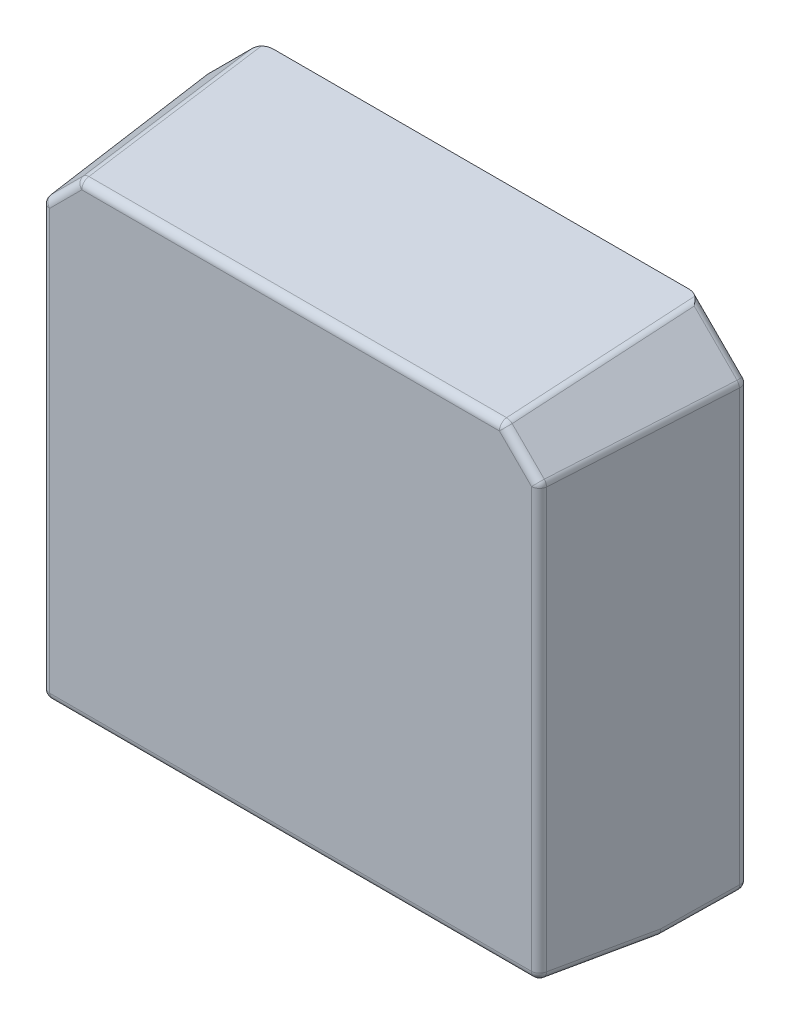
ISO-10303-21;
HEADER;
FILE_DESCRIPTION(('STEP AP214'),'2;1');
FILE_NAME('part.step','',(''),(''),'','','');
FILE_SCHEMA(('AUTOMOTIVE_DESIGN { 1 0 10303 214 1 1 1 1 }'));
ENDSEC;
DATA;
#1=APPLICATION_CONTEXT('core data for automotive mechanical design processes');
#2=APPLICATION_PROTOCOL_DEFINITION('international standard','automotive_design',2000,#1);
#3=PRODUCT_CONTEXT('',#1,'mechanical');
#4=PRODUCT('Part','Part','',(#3));
#5=PRODUCT_RELATED_PRODUCT_CATEGORY('part','',(#4));
#6=PRODUCT_DEFINITION_FORMATION('','',#4);
#7=PRODUCT_DEFINITION_CONTEXT('part definition',#1,'design');
#8=PRODUCT_DEFINITION('design','',#6,#7);
#9=PRODUCT_DEFINITION_SHAPE('','',#8);
#10=(LENGTH_UNIT() NAMED_UNIT(*) SI_UNIT(.MILLI.,.METRE.));
#11=(NAMED_UNIT(*) PLANE_ANGLE_UNIT() SI_UNIT($,.RADIAN.));
#12=(NAMED_UNIT(*) SI_UNIT($,.STERADIAN.) SOLID_ANGLE_UNIT());
#13=UNCERTAINTY_MEASURE_WITH_UNIT(LENGTH_MEASURE(1.E-05),#10,'distance_accuracy_value','');
#14=(GEOMETRIC_REPRESENTATION_CONTEXT(3) GLOBAL_UNCERTAINTY_ASSIGNED_CONTEXT((#13)) GLOBAL_UNIT_ASSIGNED_CONTEXT((#10,
#11,#12)) REPRESENTATION_CONTEXT('',''));
#15=CARTESIAN_POINT('',(0.,0.,0.));
#16=DIRECTION('',(0.,0.,1.));
#17=DIRECTION('',(1.,0.,0.));
#18=AXIS2_PLACEMENT_3D('',#15,#16,#17);
#19=CARTESIAN_POINT('',(0.,0.,2.4));
#20=DIRECTION('',(0.,0.,1.));
#21=DIRECTION('',(0.707106781186548,0.707106781186548,0.));
#22=AXIS2_PLACEMENT_3D('',#19,#20,#21);
#23=PLANE('',#22);
#24=DIRECTION('',(-9.08183003232059E-13,1.,0.));
#25=VECTOR('',#24,1.);
#26=CARTESIAN_POINT('',(5.29981151563744,2.16324235970594,2.4));
#27=LINE('',#26,#25);
#28=CARTESIAN_POINT('',(5.29981151563744,2.16324235970596,2.4));
#29=VERTEX_POINT('',#28);
#30=CARTESIAN_POINT('',(5.29981151563279,7.40908931600959,2.4));
#31=VERTEX_POINT('',#30);
#32=EDGE_CURVE('E11',#29,#31,#27,.T.);
#33=ORIENTED_EDGE('',*,*,#32,.T.);
#34=DIRECTION('',(-0.707106781186547,0.707106781186548,0.));
#35=VECTOR('',#34,1.);
#36=CARTESIAN_POINT('',(5.29981151563268,7.40908931600944,2.4));
#37=LINE('',#36,#35);
#38=CARTESIAN_POINT('',(4.89908931600094,7.80981151564132,2.4));
#39=VERTEX_POINT('',#38);
#40=EDGE_CURVE('E26',#31,#39,#37,.T.);
#41=ORIENTED_EDGE('',*,*,#40,.T.);
#42=DIRECTION('',(-1.,-6.6262173676464E-13,0.));
#43=VECTOR('',#42,1.);
#44=CARTESIAN_POINT('',(4.89908931600097,7.80981151564114,2.4));
#45=LINE('',#44,#43);
#46=CARTESIAN_POINT('',(-0.319089316012182,7.80981151563779,2.4));
#47=VERTEX_POINT('',#46);
#48=EDGE_CURVE('E999',#39,#47,#45,.T.);
#49=ORIENTED_EDGE('',*,*,#48,.T.);
#50=DIRECTION('',(-0.707106781185613,-0.707106781187482,0.));
#51=VECTOR('',#50,1.);
#52=CARTESIAN_POINT('',(-0.319089316012032,7.80981151563769,2.4));
#53=LINE('',#52,#51);
#54=CARTESIAN_POINT('',(-0.71981151564332,7.40908931600549,2.4));
#55=VERTEX_POINT('',#54);
#56=EDGE_CURVE('E998',#47,#55,#53,.T.);
#57=ORIENTED_EDGE('',*,*,#56,.T.);
#58=DIRECTION('',(9.08183003232113E-13,-1.,0.));
#59=VECTOR('',#58,1.);
#60=CARTESIAN_POINT('',(-0.719811515643137,7.40908931600552,2.4));
#61=LINE('',#60,#59);
#62=CARTESIAN_POINT('',(-0.719811515638372,2.16324235970231,2.4));
#63=VERTEX_POINT('',#62);
#64=EDGE_CURVE('E412',#55,#63,#61,.T.);
#65=ORIENTED_EDGE('',*,*,#64,.T.);
#66=DIRECTION('',(1.,6.08115713853634E-13,0.));
#67=VECTOR('',#66,1.);
#68=CARTESIAN_POINT('',(-0.719811515638372,2.1632423597023,2.4));
#69=LINE('',#68,#67);
#70=EDGE_CURVE('E409',#63,#29,#69,.T.);
#71=ORIENTED_EDGE('',*,*,#70,.T.);
#72=EDGE_LOOP('',(#33,#41,#49,#57,#65,#71));
#73=FACE_BOUND('',#72,.T.);
#74=ADVANCED_FACE('F16',(#73),#23,.T.);
#75=CARTESIAN_POINT('',(-1.36,1.94999999999914,1.01));
#76=DIRECTION('',(6.05844652791076E-13,-0.996194698091746,0.087155742747658));
#77=DIRECTION('',(0.705757556807933,0.0617457854188765,0.705757556807933));
#78=AXIS2_PLACEMENT_3D('',#75,#76,#77);
#79=PLANE('',#78);
#80=DIRECTION('',(-0.104135022431484,0.0866818917023642,0.990778555861043));
#81=VECTOR('',#80,1.);
#82=CARTESIAN_POINT('',(5.43539597913032,1.95076251394843,1.01871557427477));
#83=LINE('',#82,#81);
#84=CARTESIAN_POINT('',(5.43539597913032,1.95076251394843,1.01871557427477));
#85=VERTEX_POINT('',#84);
#86=CARTESIAN_POINT('',(5.2998115156375,2.06362288989679,2.30871557427477));
#87=VERTEX_POINT('',#86);
#88=EDGE_CURVE('E407',#85,#87,#83,.T.);
#89=ORIENTED_EDGE('',*,*,#88,.T.);
#90=DIRECTION('',(1.,6.08189487445027E-13,0.));
#91=VECTOR('',#90,1.);
#92=CARTESIAN_POINT('',(-0.719811515638312,2.06362288989313,2.30871557427477));
#93=LINE('',#92,#91);
#94=CARTESIAN_POINT('',(-0.719811515638312,2.06362288989313,2.30871557427477));
#95=VERTEX_POINT('',#94);
#96=EDGE_CURVE('E226',#95,#87,#93,.T.);
#97=ORIENTED_EDGE('',*,*,#96,.F.);
#98=DIRECTION('',(-0.104135022431328,-0.0866818917024912,-0.990778555861048));
#99=VECTOR('',#98,1.);
#100=CARTESIAN_POINT('',(-0.719811515638312,2.06362288989313,2.30871557427477));
#101=LINE('',#100,#99);
#102=CARTESIAN_POINT('',(-0.855395979130932,1.9507625139446,1.01871557427477));
#103=VERTEX_POINT('',#102);
#104=EDGE_CURVE('E410',#95,#103,#101,.T.);
#105=ORIENTED_EDGE('',*,*,#104,.T.);
#106=DIRECTION('',(1.,6.08198556373928E-13,0.));
#107=VECTOR('',#106,1.);
#108=CARTESIAN_POINT('',(-0.855395979130932,1.9507625139446,1.01871557427477));
#109=LINE('',#108,#107);
#110=EDGE_CURVE('E182',#103,#85,#109,.T.);
#111=ORIENTED_EDGE('',*,*,#110,.T.);
#112=EDGE_LOOP('',(#89,#97,#105,#111));
#113=FACE_BOUND('',#112,.T.);
#114=ADVANCED_FACE('F408',(#113),#79,.T.);
#115=CARTESIAN_POINT('',(-1.18414778631301,2.12585221368635,-1.));
#116=DIRECTION('',(6.05821881194367E-13,-0.996194698091746,-0.0871557427476582));
#117=DIRECTION('',(0.705757556807971,-0.0617457854180215,0.705757556807971));
#118=AXIS2_PLACEMENT_3D('',#115,#116,#117);
#119=PLANE('',#118);
#120=DIRECTION('',(-0.104135022431335,-0.0866818917024914,0.990778555861048));
#121=VECTOR('',#120,1.);
#122=CARTESIAN_POINT('',(5.52893874851671,2.02862742448656,0.111284425725234));
#123=LINE('',#122,#121);
#124=CARTESIAN_POINT('',(5.52893874851671,2.02862742448656,0.111284425725234));
#125=VERTEX_POINT('',#124);
#126=CARTESIAN_POINT('',(5.43539597913032,1.95076251394843,1.00128442572524));
#127=VERTEX_POINT('',#126);
#128=EDGE_CURVE('E418',#125,#127,#123,.T.);
#129=ORIENTED_EDGE('',*,*,#128,.T.);
#130=DIRECTION('',(1.,6.08127962844085E-13,0.));
#131=VECTOR('',#130,1.);
#132=CARTESIAN_POINT('',(-0.855395979130932,1.9507625139446,1.00128442572523));
#133=LINE('',#132,#131);
#134=CARTESIAN_POINT('',(-0.855395979130932,1.9507625139446,1.00128442572523));
#135=VERTEX_POINT('',#134);
#136=EDGE_CURVE('E405',#135,#127,#133,.T.);
#137=ORIENTED_EDGE('',*,*,#136,.F.);
#138=DIRECTION('',(-0.104135022431485,0.0866818917023642,-0.990778555861043));
#139=VECTOR('',#138,1.);
#140=CARTESIAN_POINT('',(-0.855395979130932,1.9507625139446,1.00128442572523));
#141=LINE('',#140,#139);
#142=CARTESIAN_POINT('',(-0.948938748517455,2.02862742448262,0.111284425725234));
#143=VERTEX_POINT('',#142);
#144=EDGE_CURVE('E176',#135,#143,#141,.T.);
#145=ORIENTED_EDGE('',*,*,#144,.T.);
#146=DIRECTION('',(-1.,-6.08149101674673E-13,0.));
#147=VECTOR('',#146,1.);
#148=CARTESIAN_POINT('',(-0.948938748517455,2.02862742448262,0.111284425725234));
#149=LINE('',#148,#147);
#150=EDGE_CURVE('E314',#125,#143,#149,.T.);
#151=ORIENTED_EDGE('',*,*,#150,.F.);
#152=EDGE_LOOP('',(#129,#137,#145,#151));
#153=FACE_BOUND('',#152,.T.);
#154=ADVANCED_FACE('F438',(#153),#119,.T.);
#155=CARTESIAN_POINT('',(0.,0.,0.02));
#156=DIRECTION('',(0.,0.,1.));
#157=DIRECTION('',(0.707106781186548,0.707106781186548,0.));
#158=AXIS2_PLACEMENT_3D('',#155,#156,#157);
#159=PLANE('',#158);
#160=DIRECTION('',(0.70710678118655,-0.707106781186546,0.));
#161=VECTOR('',#160,1.);
#162=CARTESIAN_POINT('',(5.52893874851176,7.5039969233771,0.02));
#163=LINE('',#162,#161);
#164=CARTESIAN_POINT('',(4.88293567188563,8.15000000000323,0.02));
#165=VERTEX_POINT('',#164);
#166=CARTESIAN_POINT('',(5.52893874851204,7.50399692337708,0.02));
#167=VERTEX_POINT('',#166);
#168=EDGE_CURVE('E423',#165,#167,#163,.T.);
#169=ORIENTED_EDGE('',*,*,#168,.T.);
#170=DIRECTION('',(9.08376491669893E-13,-1.,0.));
#171=VECTOR('',#170,1.);
#172=CARTESIAN_POINT('',(5.52893874851665,2.1282468942957,0.02));
#173=LINE('',#172,#171);
#174=CARTESIAN_POINT('',(5.52893874851665,2.12824689429573,0.02));
#175=VERTEX_POINT('',#174);
#176=EDGE_CURVE('E353',#167,#175,#173,.T.);
#177=ORIENTED_EDGE('',*,*,#176,.T.);
#178=DIRECTION('',(-1.,-6.08217656415026E-13,0.));
#179=VECTOR('',#178,1.);
#180=CARTESIAN_POINT('',(-0.948938748517515,2.12824689429179,0.02));
#181=LINE('',#180,#179);
#182=CARTESIAN_POINT('',(-0.948938748517515,2.1282468942918,0.02));
#183=VERTEX_POINT('',#182);
#184=EDGE_CURVE('E351',#175,#183,#181,.T.);
#185=ORIENTED_EDGE('',*,*,#184,.T.);
#186=DIRECTION('',(-9.08231924658281E-13,1.,0.));
#187=VECTOR('',#186,1.);
#188=CARTESIAN_POINT('',(-0.948938748522398,7.50399692337283,0.02));
#189=LINE('',#188,#187);
#190=CARTESIAN_POINT('',(-0.9489387485225,7.50399692337295,0.02));
#191=VERTEX_POINT('',#190);
#192=EDGE_CURVE('E343',#183,#191,#189,.T.);
#193=ORIENTED_EDGE('',*,*,#192,.T.);
#194=DIRECTION('',(0.70710678118561,0.707106781187485,0.));
#195=VECTOR('',#194,1.);
#196=CARTESIAN_POINT('',(-0.302935671897146,8.14999999999979,0.02));
#197=LINE('',#196,#195);
#198=CARTESIAN_POINT('',(-0.302935671897146,8.14999999999979,0.02));
#199=VERTEX_POINT('',#198);
#200=EDGE_CURVE('E339',#191,#199,#197,.T.);
#201=ORIENTED_EDGE('',*,*,#200,.T.);
#202=DIRECTION('',(1.,6.62810597559526E-13,0.));
#203=VECTOR('',#202,1.);
#204=CARTESIAN_POINT('',(4.88293567188563,8.15000000000323,0.02));
#205=LINE('',#204,#203);
#206=EDGE_CURVE('E344',#199,#165,#205,.T.);
#207=ORIENTED_EDGE('',*,*,#206,.T.);
#208=EDGE_LOOP('',(#169,#177,#185,#193,#201,#207));
#209=FACE_BOUND('',#208,.T.);
#210=ADVANCED_FACE('F348',(#209),#159,.F.);
#211=CARTESIAN_POINT('',(-0.809851920072954,7.44638527268179,2.4));
#212=DIRECTION('',(-0.703233176254335,0.703233176252473,0.104528463267653));
#213=DIRECTION('',(0.630457498195542,0.548873092330558,0.548873092330558));
#214=AXIS2_PLACEMENT_3D('',#211,#212,#213);
#215=PLANE('',#214);
#216=DIRECTION('',(-0.707106781185612,-0.707106781187483,0.));
#217=VECTOR('',#216,1.);
#218=CARTESIAN_POINT('',(-0.389412633637465,7.88013483326293,2.31045284632677));
#219=LINE('',#218,#217);
#220=CARTESIAN_POINT('',(-0.389412633637471,7.88013483326291,2.31045284632691));
#221=VERTEX_POINT('',#220);
#222=CARTESIAN_POINT('',(-0.790134833268769,7.4794126336305,2.31045284632722));
#223=VERTEX_POINT('',#222);
#224=EDGE_CURVE('E294',#221,#223,#219,.T.);
#225=ORIENTED_EDGE('',*,*,#224,.F.);
#226=DIRECTION('',(-0.0432565808764457,0.10443062421351,-0.993591018949576));
#227=VECTOR('',#226,1.);
#228=CARTESIAN_POINT('',(-0.389412633637465,7.88013483326293,2.31045284632677));
#229=LINE('',#228,#227);
#230=CARTESIAN_POINT('',(-0.484320241005278,8.10926206614204,0.130452846326766));
#231=VERTEX_POINT('',#230);
#232=EDGE_CURVE('E358',#221,#231,#229,.T.);
#233=ORIENTED_EDGE('',*,*,#232,.T.);
#234=DIRECTION('',(0.707106781185612,0.707106781187483,0.));
#235=VECTOR('',#234,1.);
#236=CARTESIAN_POINT('',(-0.484320241005278,8.10926206614204,0.130452846326766));
#237=LINE('',#236,#235);
#238=CARTESIAN_POINT('',(-1.01926206614783,7.5743202409981,0.130452846326607));
#239=VERTEX_POINT('',#238);
#240=EDGE_CURVE('E256',#239,#231,#237,.T.);
#241=ORIENTED_EDGE('',*,*,#240,.F.);
#242=DIRECTION('',(-0.104430624213579,0.0432565808762159,-0.993591018949578));
#243=VECTOR('',#242,1.);
#244=CARTESIAN_POINT('',(-0.79013483326857,7.47941263363077,2.31045284632677));
#245=LINE('',#244,#243);
#246=EDGE_CURVE('E227',#223,#239,#245,.T.);
#247=ORIENTED_EDGE('',*,*,#246,.F.);
#248=EDGE_LOOP('',(#225,#233,#241,#247));
#249=FACE_BOUND('',#248,.T.);
#250=ADVANCED_FACE('F462',(#249),#215,.T.);
#251=CARTESIAN_POINT('',(-0.356385272688502,7.89985192006745,2.4));
#252=DIRECTION('',(-6.59050407435661E-13,0.994521895368273,0.104528463267653));
#253=DIRECTION('',(0.705161999394304,-0.0741155126842861,0.705161999394304));
#254=AXIS2_PLACEMENT_3D('',#251,#252,#253);
#255=PLANE('',#254);
#256=DIRECTION('',(-1.,-6.6262173676464E-13,0.));
#257=VECTOR('',#256,1.);
#258=CARTESIAN_POINT('',(4.89908931600091,7.90926370517797,2.31045284632677));
#259=LINE('',#258,#257);
#260=CARTESIAN_POINT('',(4.89908931600087,7.90926370517794,2.31045284632701));
#261=VERTEX_POINT('',#260);
#262=CARTESIAN_POINT('',(-0.319089316012286,7.90926370517449,2.31045284632703));
#263=VERTEX_POINT('',#262);
#264=EDGE_CURVE('E288',#261,#263,#259,.T.);
#265=ORIENTED_EDGE('',*,*,#264,.F.);
#266=DIRECTION('',(0.043256580876307,0.104430624213567,-0.993591018949576));
#267=VECTOR('',#266,1.);
#268=CARTESIAN_POINT('',(4.89908931600091,7.90926370517797,2.31045284632677));
#269=LINE('',#268,#267);
#270=CARTESIAN_POINT('',(4.99717640306542,8.14606688106303,0.0574211270395492));
#271=VERTEX_POINT('',#270);
#272=EDGE_CURVE('E361',#261,#271,#269,.T.);
#273=ORIENTED_EDGE('',*,*,#272,.T.);
#274=CARTESIAN_POINT('',(4.89344609541201,8.13948957647661,0.120000000000415));
#275=DIRECTION('',(6.63652401607198E-13,-0.99452189536826,-0.104528463267785));
#276=DIRECTION('',(0.994581264610285,-0.0108669934476841,0.103392536189099));
#277=AXIS2_PLACEMENT_3D('',#274,#275,#276);
#278=ELLIPSE('',#277,0.142200344603933,0.100000000000437);
#279=EDGE_CURVE('E263',#165,#271,#278,.T.);
#280=ORIENTED_EDGE('',*,*,#279,.F.);
#281=ORIENTED_EDGE('',*,*,#206,.F.);
#282=CARTESIAN_POINT('',(-0.313446095423615,8.13948957647319,0.120000000000134));
#283=DIRECTION('',(6.524278179281E-13,-0.994521895368261,-0.104528463267769));
#284=DIRECTION('',(0.994581264610187,0.0108669934490825,-0.103392536189897));
#285=AXIS2_PLACEMENT_3D('',#282,#283,#284);
#286=ELLIPSE('',#285,0.142200344603731,0.100000000000142);
#287=CARTESIAN_POINT('',(-0.417176402572797,8.14606688114393,0.0574211262356998));
#288=VERTEX_POINT('',#287);
#289=EDGE_CURVE('E247',#288,#199,#286,.T.);
#290=ORIENTED_EDGE('',*,*,#289,.F.);
#291=DIRECTION('',(-0.0432565808764457,0.10443062421351,-0.993591018949576));
#292=VECTOR('',#291,1.);
#293=CARTESIAN_POINT('',(-0.319089316012097,7.90926370517451,2.31045284632677));
#294=LINE('',#293,#292);
#295=EDGE_CURVE('E251',#263,#288,#294,.T.);
#296=ORIENTED_EDGE('',*,*,#295,.F.);
#297=EDGE_LOOP('',(#265,#273,#280,#281,#290,#296));
#298=FACE_BOUND('',#297,.T.);
#299=ADVANCED_FACE('F465',(#298),#255,.T.);
#300=CARTESIAN_POINT('',(4.93638527267732,7.89985192007095,2.4));
#301=DIRECTION('',(0.703233176253403,0.703233176253405,0.104528463267654));
#302=DIRECTION('',(-0.630457498196484,0.548873092330017,0.548873092330017));
#303=AXIS2_PLACEMENT_3D('',#300,#301,#302);
#304=PLANE('',#303);
#305=DIRECTION('',(-0.707106781186548,0.707106781186547,0.));
#306=VECTOR('',#305,1.);
#307=CARTESIAN_POINT('',(5.37013483325802,7.47941263363478,2.31045284632677));
#308=LINE('',#307,#306);
#309=CARTESIAN_POINT('',(5.37013483325797,7.47941263363479,2.31045284632701));
#310=VERTEX_POINT('',#309);
#311=CARTESIAN_POINT('',(4.96941263362604,7.88013483326668,2.31045284632722));
#312=VERTEX_POINT('',#311);
#313=EDGE_CURVE('E282',#310,#312,#308,.T.);
#314=ORIENTED_EDGE('',*,*,#313,.F.);
#315=DIRECTION('',(0.104430624213501,0.0432565808763762,-0.99359101894958));
#316=VECTOR('',#315,1.);
#317=CARTESIAN_POINT('',(5.37013483325802,7.47941263363478,2.31045284632677));
#318=LINE('',#317,#316);
#319=CARTESIAN_POINT('',(5.59926206613737,7.57432024100224,0.130452846326345));
#320=VERTEX_POINT('',#319);
#321=EDGE_CURVE('E313',#310,#320,#318,.T.);
#322=ORIENTED_EDGE('',*,*,#321,.T.);
#323=DIRECTION('',(0.707106781186549,-0.707106781186546,0.));
#324=VECTOR('',#323,1.);
#325=CARTESIAN_POINT('',(5.5992620661371,7.57432024100244,0.130452846326766));
#326=LINE('',#325,#324);
#327=CARTESIAN_POINT('',(5.06432024099382,8.10926206614572,0.130452846326765));
#328=VERTEX_POINT('',#327);
#329=EDGE_CURVE('E264',#328,#320,#326,.T.);
#330=ORIENTED_EDGE('',*,*,#329,.F.);
#331=DIRECTION('',(0.0432565808763068,0.104430624213569,-0.993591018949575));
#332=VECTOR('',#331,1.);
#333=CARTESIAN_POINT('',(4.96941263362631,7.88013483326648,2.31045284632677));
#334=LINE('',#333,#332);
#335=EDGE_CURVE('E259',#312,#328,#334,.T.);
#336=ORIENTED_EDGE('',*,*,#335,.F.);
#337=EDGE_LOOP('',(#314,#322,#330,#336));
#338=FACE_BOUND('',#337,.T.);
#339=ADVANCED_FACE('F469',(#338),#304,.T.);
#340=CARTESIAN_POINT('',(5.38985192006243,7.44638527268585,2.4));
#341=DIRECTION('',(0.994521895368273,9.03183040849487E-13,0.104528463267653));
#342=DIRECTION('',(-0.0741155126853878,0.705161999394246,0.705161999394246));
#343=AXIS2_PLACEMENT_3D('',#340,#341,#342);
#344=PLANE('',#343);
#345=DIRECTION('',(-0.104135022431329,-0.0866818917024902,0.990778555861048));
#346=VECTOR('',#345,1.);
#347=CARTESIAN_POINT('',(5.62839093805347,2.12824689429583,0.130452846326765));
#348=LINE('',#347,#346);
#349=CARTESIAN_POINT('',(5.62839093805347,2.12824689429582,0.130452846326765));
#350=VERTEX_POINT('',#349);
#351=CARTESIAN_POINT('',(5.53484816866709,2.0503819837577,1.02045284632678));
#352=VERTEX_POINT('',#351);
#353=EDGE_CURVE('E203',#350,#352,#348,.T.);
#354=ORIENTED_EDGE('',*,*,#353,.F.);
#355=DIRECTION('',(9.0821127222798E-13,-1.,0.));
#356=VECTOR('',#355,1.);
#357=CARTESIAN_POINT('',(5.62839093805347,2.12824689429582,0.130452846326765));
#358=LINE('',#357,#356);
#359=CARTESIAN_POINT('',(5.62839093804861,7.50399692337718,0.130452846326607));
#360=VERTEX_POINT('',#359);
#361=EDGE_CURVE('E273',#360,#350,#358,.T.);
#362=ORIENTED_EDGE('',*,*,#361,.F.);
#363=DIRECTION('',(0.104430624213501,0.0432565808763766,-0.99359101894958));
#364=VECTOR('',#363,1.);
#365=CARTESIAN_POINT('',(5.3992637051695,7.40908931600953,2.31045284632677));
#366=LINE('',#365,#364);
#367=CARTESIAN_POINT('',(5.39926370516946,7.40908931600986,2.31045284632722));
#368=VERTEX_POINT('',#367);
#369=EDGE_CURVE('E234',#368,#360,#366,.T.);
#370=ORIENTED_EDGE('',*,*,#369,.F.);
#371=DIRECTION('',(-9.08183003232064E-13,1.,0.));
#372=VECTOR('',#371,1.);
#373=CARTESIAN_POINT('',(5.39926370517427,2.16324235970605,2.31045284632677));
#374=LINE('',#373,#372);
#375=CARTESIAN_POINT('',(5.39926370517427,2.16324235970605,2.31045284632677));
#376=VERTEX_POINT('',#375);
#377=EDGE_CURVE('E277',#376,#368,#374,.T.);
#378=ORIENTED_EDGE('',*,*,#377,.F.);
#379=DIRECTION('',(-0.104135022431484,0.0866818917023645,0.990778555861043));
#380=VECTOR('',#379,1.);
#381=CARTESIAN_POINT('',(5.53484816866709,2.0503819837577,1.02045284632678));
#382=LINE('',#381,#380);
#383=EDGE_CURVE('E206',#352,#376,#382,.T.);
#384=ORIENTED_EDGE('',*,*,#383,.F.);
#385=EDGE_LOOP('',(#354,#362,#370,#378,#384));
#386=FACE_BOUND('',#385,.T.);
#387=ADVANCED_FACE('F391',(#386),#344,.T.);
#388=CARTESIAN_POINT('',(-0.809851920067917,1.9001480799318,2.4));
#389=DIRECTION('',(-0.994521895368273,-9.0324276464428E-13,0.104528463267654));
#390=DIRECTION('',(0.0741155126841147,0.705161999394313,0.705161999394313));
#391=AXIS2_PLACEMENT_3D('',#388,#389,#390);
#392=PLANE('',#391);
#393=DIRECTION('',(-0.104135022431485,0.086681891702366,-0.990778555861043));
#394=VECTOR('',#393,1.);
#395=CARTESIAN_POINT('',(-0.954848168667821,2.05038198375369,1.02045284632676));
#396=LINE('',#395,#394);
#397=CARTESIAN_POINT('',(-0.95484816866782,2.05038198375369,1.02045284632676));
#398=VERTEX_POINT('',#397);
#399=CARTESIAN_POINT('',(-1.04839093805434,2.1282468942917,0.130452846326766));
#400=VERTEX_POINT('',#399);
#401=EDGE_CURVE('E192',#398,#400,#396,.T.);
#402=ORIENTED_EDGE('',*,*,#401,.F.);
#403=DIRECTION('',(-0.104135022431328,-0.0866818917024917,-0.990778555861048));
#404=VECTOR('',#403,1.);
#405=CARTESIAN_POINT('',(-0.8192637051752,2.16324235970221,2.31045284632677));
#406=LINE('',#405,#404);
#407=CARTESIAN_POINT('',(-0.8192637051752,2.16324235970221,2.31045284632677));
#408=VERTEX_POINT('',#407);
#409=EDGE_CURVE('E187',#408,#398,#406,.T.);
#410=ORIENTED_EDGE('',*,*,#409,.F.);
#411=DIRECTION('',(9.08225330926145E-13,-1.,0.));
#412=VECTOR('',#411,1.);
#413=CARTESIAN_POINT('',(-0.819263705179964,7.40908931600543,2.31045284632677));
#414=LINE('',#413,#412);
#415=CARTESIAN_POINT('',(-0.819263705179938,7.40908931600539,2.31045284632701));
#416=VERTEX_POINT('',#415);
#417=EDGE_CURVE('E301',#416,#408,#414,.T.);
#418=ORIENTED_EDGE('',*,*,#417,.F.);
#419=DIRECTION('',(-0.104430624213579,0.0432565808762163,-0.993591018949578));
#420=VECTOR('',#419,1.);
#421=CARTESIAN_POINT('',(-0.819263705179964,7.40908931600543,2.31045284632677));
#422=LINE('',#421,#420);
#423=CARTESIAN_POINT('',(-1.04839093805927,7.50399692337307,0.130452846326345));
#424=VERTEX_POINT('',#423);
#425=EDGE_CURVE('E311',#416,#424,#422,.T.);
#426=ORIENTED_EDGE('',*,*,#425,.T.);
#427=DIRECTION('',(-9.08211272228037E-13,1.,0.));
#428=VECTOR('',#427,1.);
#429=CARTESIAN_POINT('',(-1.04839093805922,7.50399692337274,0.130452846326766));
#430=LINE('',#429,#428);
#431=EDGE_CURVE('E241',#400,#424,#430,.T.);
#432=ORIENTED_EDGE('',*,*,#431,.F.);
#433=EDGE_LOOP('',(#402,#410,#418,#426,#432));
#434=FACE_BOUND('',#433,.T.);
#435=ADVANCED_FACE('F330',(#434),#392,.T.);
#436=CARTESIAN_POINT('',(-1.46000000000041,2.12824689429148,0.12));
#437=DIRECTION('',(1.,6.08165369915999E-13,0.));
#438=DIRECTION('',(6.05851117073323E-13,-0.996194698091745,-0.0871557427476586));
#439=AXIS2_PLACEMENT_3D('',#436,#437,#438);
#440=CYLINDRICAL_SURFACE('',#439,0.1);
#441=CARTESIAN_POINT('',(5.52893874851665,2.12824689429573,0.12));
#442=DIRECTION('',(1.,6.08165369915999E-13,0.));
#443=DIRECTION('',(6.05851117073323E-13,-0.996194698091745,-0.0871557427476588));
#444=AXIS2_PLACEMENT_3D('',#441,#442,#443);
#445=CIRCLE('',#444,0.1);
#446=EDGE_CURVE('E215',#125,#175,#445,.T.);
#447=ORIENTED_EDGE('',*,*,#446,.F.);
#448=ORIENTED_EDGE('',*,*,#150,.T.);
#449=CARTESIAN_POINT('',(-0.948938748517515,2.12824689429179,0.12));
#450=DIRECTION('',(-1.,-6.08165369915999E-13,0.));
#451=DIRECTION('',(6.05851117073323E-13,-0.996194698091745,-0.0871557427476588));
#452=AXIS2_PLACEMENT_3D('',#449,#450,#451);
#453=CIRCLE('',#452,0.1);
#454=EDGE_CURVE('E208',#183,#143,#453,.T.);
#455=ORIENTED_EDGE('',*,*,#454,.F.);
#456=ORIENTED_EDGE('',*,*,#184,.F.);
#457=EDGE_LOOP('',(#447,#448,#455,#456));
#458=FACE_BOUND('',#457,.T.);
#459=ADVANCED_FACE('F440',(#458),#440,.T.);
#460=CARTESIAN_POINT('',(-1.35594680708731,2.05038198375347,1.01));
#461=DIRECTION('',(1.,6.08165050699947E-13,0.));
#462=DIRECTION('',(6.05818951439275E-13,-0.996194698091746,0.0871557427476553));
#463=AXIS2_PLACEMENT_3D('',#460,#461,#462);
#464=CYLINDRICAL_SURFACE('',#463,0.1);
#465=CARTESIAN_POINT('',(5.4353959790081,2.05038198594977,1.01000000005321));
#466=DIRECTION('',(0.743012456972001,0.0583313852046114,-0.666730783963468));
#467=DIRECTION('',(0.669277587241968,-0.0647578048186809,0.740185070053859));
#468=AXIS2_PLACEMENT_3D('',#465,#466,#467);
#469=ELLIPSE('',#468,0.134587247038804,0.100000002188465);
#470=CARTESIAN_POINT('',(5.44406380785314,1.95038613364005,1.01091102672857));
#471=VERTEX_POINT('',#470);
#472=EDGE_CURVE('E162',#471,#127,#469,.T.);
#473=ORIENTED_EDGE('',*,*,#472,.F.);
#474=CARTESIAN_POINT('',(5.43539597908686,2.05038198562347,1.00999999987501));
#475=DIRECTION('',(0.669277587242387,0.0647578025659602,0.740185070250568));
#476=DIRECTION('',(0.743012456971624,-0.0583313856857532,-0.666730783921795));
#477=AXIS2_PLACEMENT_3D('',#474,#475,#476);
#478=ELLIPSE('',#477,0.149414835998616,0.100000001869665);
#479=EDGE_CURVE('E207',#85,#471,#478,.T.);
#480=ORIENTED_EDGE('',*,*,#479,.F.);
#481=ORIENTED_EDGE('',*,*,#110,.F.);
#482=CARTESIAN_POINT('',(-0.855395979311085,2.05038197886638,1.01000000026148));
#483=DIRECTION('',(-0.669277587241709,0.0647578025819277,0.740185070249784));
#484=DIRECTION('',(0.743012456972235,0.0583313832430859,0.666730784134819));
#485=AXIS2_PLACEMENT_3D('',#482,#483,#484);
#486=ELLIPSE('',#485,0.149414830943187,0.0999999951084135);
#487=CARTESIAN_POINT('',(-0.864063807853754,1.95038613363621,1.01091102672856));
#488=VERTEX_POINT('',#487);
#489=EDGE_CURVE('E180',#488,#103,#486,.T.);
#490=ORIENTED_EDGE('',*,*,#489,.F.);
#491=CARTESIAN_POINT('',(-0.85539597903909,2.05038198543425,1.01000000004416));
#492=DIRECTION('',(-0.743012456972287,0.0583313852170258,-0.666730783962064));
#493=DIRECTION('',(0.669277587241651,0.0647578042443351,-0.740185070104394));
#494=AXIS2_PLACEMENT_3D('',#491,#492,#493);
#495=ELLIPSE('',#494,0.13458724669518,0.100000001677931);
#496=EDGE_CURVE('E169',#135,#488,#495,.T.);
#497=ORIENTED_EDGE('',*,*,#496,.F.);
#498=ORIENTED_EDGE('',*,*,#136,.T.);
#499=EDGE_LOOP('',(#473,#480,#481,#490,#497,#498));
#500=FACE_BOUND('',#499,.T.);
#501=ADVANCED_FACE('F181',(#500),#464,.T.);
#502=CARTESIAN_POINT('',(-1.20985192006813,2.16324235970201,2.3));
#503=DIRECTION('',(1.,6.08174183200923E-13,0.));
#504=DIRECTION('',(0.,0.,1.));
#505=AXIS2_PLACEMENT_3D('',#502,#503,#504);
#506=CYLINDRICAL_SURFACE('',#505,0.1);
#507=CARTESIAN_POINT('',(5.29981151563744,2.16324235970596,2.3));
#508=DIRECTION('',(1.,6.08174183200923E-13,0.));
#509=DIRECTION('',(6.05859896821037E-13,-0.996194698091745,0.0871557427476606));
#510=AXIS2_PLACEMENT_3D('',#507,#508,#509);
#511=CIRCLE('',#510,0.1);
#512=EDGE_CURVE('E177',#29,#87,#511,.T.);
#513=ORIENTED_EDGE('',*,*,#512,.F.);
#514=ORIENTED_EDGE('',*,*,#70,.F.);
#515=CARTESIAN_POINT('',(-0.719811515638372,2.1632423597023,2.3));
#516=DIRECTION('',(-1.,-6.08174183200923E-13,0.));
#517=DIRECTION('',(6.05859896821037E-13,-0.996194698091745,0.087155742747663));
#518=AXIS2_PLACEMENT_3D('',#515,#516,#517);
#519=CIRCLE('',#518,0.1);
#520=EDGE_CURVE('E186',#95,#63,#519,.T.);
#521=ORIENTED_EDGE('',*,*,#520,.F.);
#522=ORIENTED_EDGE('',*,*,#96,.T.);
#523=EDGE_LOOP('',(#513,#514,#521,#522));
#524=FACE_BOUND('',#523,.T.);
#525=ADVANCED_FACE('F403',(#524),#506,.T.);
#526=CARTESIAN_POINT('',(-0.668813569003997,7.38796527485448,2.78521305074159));
#527=DIRECTION('',(0.104430624213579,-0.0432565808762158,0.993591018949578));
#528=DIRECTION('',(-0.703233176254336,0.703233176252472,0.104528463267653));
#529=AXIS2_PLACEMENT_3D('',#526,#527,#528);
#530=CYLINDRICAL_SURFACE('',#529,0.1);
#531=CARTESIAN_POINT('',(-0.719811515643137,7.40908931600552,2.3));
#532=DIRECTION('',(-0.104430624213579,0.0432565808762158,-0.993591018949579));
#533=DIRECTION('',(-0.703233176254337,0.703233176252471,0.104528463267653));
#534=AXIS2_PLACEMENT_3D('',#531,#532,#533);
#535=CIRCLE('',#534,0.1);
#536=EDGE_CURVE('E223',#416,#223,#535,.T.);
#537=ORIENTED_EDGE('',*,*,#536,.T.);
#538=ORIENTED_EDGE('',*,*,#246,.T.);
#539=CARTESIAN_POINT('',(-0.948938748522398,7.50399692337283,0.12));
#540=DIRECTION('',(0.104430624213579,-0.0432565808762158,0.993591018949579));
#541=DIRECTION('',(-0.994521895368273,-9.05510909310348E-13,0.104528463267653));
#542=AXIS2_PLACEMENT_3D('',#539,#540,#541);
#543=CIRCLE('',#542,0.1);
#544=EDGE_CURVE('E228',#239,#424,#543,.T.);
#545=ORIENTED_EDGE('',*,*,#544,.T.);
#546=ORIENTED_EDGE('',*,*,#425,.F.);
#547=EDGE_LOOP('',(#537,#538,#545,#546));
#548=FACE_BOUND('',#547,.T.);
#549=ADVANCED_FACE('F326',(#548),#530,.T.);
#550=CARTESIAN_POINT('',(5.24881356899357,7.38796527485832,2.78521305074159));
#551=DIRECTION('',(-0.1044306242135,-0.0432565808763768,0.99359101894958));
#552=DIRECTION('',(0.994521895368273,8.97105306707502E-13,0.104528463267653));
#553=AXIS2_PLACEMENT_3D('',#550,#551,#552);
#554=CYLINDRICAL_SURFACE('',#553,0.1);
#555=CARTESIAN_POINT('',(5.29981151563268,7.40908931600944,2.3));
#556=DIRECTION('',(0.1044306242135,0.0432565808763768,-0.99359101894958));
#557=DIRECTION('',(0.994521895368273,8.97146072709188E-13,0.104528463267653));
#558=AXIS2_PLACEMENT_3D('',#555,#556,#557);
#559=CIRCLE('',#558,0.1);
#560=EDGE_CURVE('E231',#310,#368,#559,.T.);
#561=ORIENTED_EDGE('',*,*,#560,.T.);
#562=ORIENTED_EDGE('',*,*,#369,.T.);
#563=CARTESIAN_POINT('',(5.52893874851176,7.5039969233771,0.12));
#564=DIRECTION('',(-0.1044306242135,-0.0432565808763768,0.99359101894958));
#565=DIRECTION('',(0.703233176253408,0.7032331762534,0.104528463267654));
#566=AXIS2_PLACEMENT_3D('',#563,#564,#565);
#567=CIRCLE('',#566,0.1);
#568=EDGE_CURVE('E235',#360,#320,#567,.T.);
#569=ORIENTED_EDGE('',*,*,#568,.T.);
#570=ORIENTED_EDGE('',*,*,#321,.F.);
#571=EDGE_LOOP('',(#561,#562,#569,#570));
#572=FACE_BOUND('',#571,.T.);
#573=ADVANCED_FACE('F522',(#572),#554,.T.);
#574=CARTESIAN_POINT('',(-0.948938748522765,7.90880555427732,0.12));
#575=DIRECTION('',(9.08216865385752E-13,-1.,0.));
#576=DIRECTION('',(-0.994521895368273,-9.0324155836887E-13,0.104528463267655));
#577=AXIS2_PLACEMENT_3D('',#574,#575,#576);
#578=CYLINDRICAL_SURFACE('',#577,0.1);
#579=CARTESIAN_POINT('',(-0.948938748517515,2.1282468942918,0.12));
#580=DIRECTION('',(-9.08216865385752E-13,1.,0.));
#581=DIRECTION('',(-0.994521895368273,-9.0324155836887E-13,0.104528463267655));
#582=AXIS2_PLACEMENT_3D('',#579,#580,#581);
#583=CIRCLE('',#582,0.1);
#584=EDGE_CURVE('E238',#183,#400,#583,.T.);
#585=ORIENTED_EDGE('',*,*,#584,.T.);
#586=ORIENTED_EDGE('',*,*,#431,.T.);
#587=CARTESIAN_POINT('',(-0.948938748522397,7.50399692337283,0.12));
#588=DIRECTION('',(9.08216865385752E-13,-1.,0.));
#589=DIRECTION('',(0.,0.,-1.));
#590=AXIS2_PLACEMENT_3D('',#587,#588,#589);
#591=CIRCLE('',#590,0.1);
#592=EDGE_CURVE('E242',#424,#191,#591,.T.);
#593=ORIENTED_EDGE('',*,*,#592,.T.);
#594=ORIENTED_EDGE('',*,*,#192,.F.);
#595=EDGE_LOOP('',(#585,#586,#593,#594));
#596=FACE_BOUND('',#595,.T.);
#597=ADVANCED_FACE('F317',(#596),#578,.T.);
#598=CARTESIAN_POINT('',(-0.948939048506196,7.50399727332604,0.119999583480734));
#599=DIRECTION('',(0.,0.,1.));
#600=DIRECTION('',(1.,0.,0.));
#601=AXIS2_PLACEMENT_3D('',#598,#599,#600);
#602=SPHERICAL_SURFACE('',#601,0.0999993104386057);
#603=ORIENTED_EDGE('',*,*,#592,.F.);
#604=ORIENTED_EDGE('',*,*,#544,.F.);
#605=CARTESIAN_POINT('',(-0.948938748522398,7.50399692337283,0.12));
#606=DIRECTION('',(-0.707106781185612,-0.707106781187483,0.));
#607=DIRECTION('',(0.,0.,-1.));
#608=AXIS2_PLACEMENT_3D('',#605,#606,#607);
#609=CIRCLE('',#608,0.1);
#610=EDGE_CURVE('E244',#239,#191,#609,.T.);
#611=ORIENTED_EDGE('',*,*,#610,.T.);
#612=EDGE_LOOP('',(#603,#604,#611));
#613=FACE_BOUND('',#612,.T.);
#614=ADVANCED_FACE('F332',(#613),#602,.T.);
#615=CARTESIAN_POINT('',(-0.0986251234733304,8.35431054842415,0.12));
#616=DIRECTION('',(-0.707106781185612,-0.707106781187483,0.));
#617=DIRECTION('',(-0.703233176254335,0.703233176252474,0.104528463267655));
#618=AXIS2_PLACEMENT_3D('',#615,#616,#617);
#619=CYLINDRICAL_SURFACE('',#618,0.1);
#620=CARTESIAN_POINT('',(-0.413996923379266,8.03893874851546,0.120000000000374));
#621=DIRECTION('',(0.542448960091993,0.435683658280356,0.718281891462232));
#622=DIRECTION('',(-0.459578312702158,-0.561821012183097,0.687855308014264));
#623=AXIS2_PLACEMENT_3D('',#620,#621,#622);
#624=ELLIPSE('',#623,0.144583008052379,0.100000000001313);
#625=EDGE_CURVE('E248',#288,#231,#624,.T.);
#626=ORIENTED_EDGE('',*,*,#625,.F.);
#627=ORIENTED_EDGE('',*,*,#289,.T.);
#628=ORIENTED_EDGE('',*,*,#200,.F.);
#629=ORIENTED_EDGE('',*,*,#610,.F.);
#630=ORIENTED_EDGE('',*,*,#240,.T.);
#631=EDGE_LOOP('',(#626,#627,#628,#629,#630));
#632=FACE_BOUND('',#631,.T.);
#633=ADVANCED_FACE('F335',(#632),#619,.T.);
#634=CARTESIAN_POINT('',(-0.297965274860875,7.75881356899858,2.78521305074158));
#635=DIRECTION('',(0.0432565808764457,-0.10443062421351,0.993591018949576));
#636=DIRECTION('',(-6.58412560583521E-13,0.994521895368273,0.104528463267653));
#637=AXIS2_PLACEMENT_3D('',#634,#635,#636);
#638=CYLINDRICAL_SURFACE('',#637,0.1);
#639=CARTESIAN_POINT('',(-0.319089316012031,7.80981151563769,2.3));
#640=DIRECTION('',(-0.0432565808764457,0.10443062421351,-0.993591018949576));
#641=DIRECTION('',(-6.58453326585207E-13,0.994521895368273,0.104528463267653));
#642=AXIS2_PLACEMENT_3D('',#639,#640,#641);
#643=CIRCLE('',#642,0.1);
#644=EDGE_CURVE('E253',#221,#263,#643,.T.);
#645=ORIENTED_EDGE('',*,*,#644,.T.);
#646=ORIENTED_EDGE('',*,*,#295,.T.);
#647=ORIENTED_EDGE('',*,*,#625,.T.);
#648=ORIENTED_EDGE('',*,*,#232,.F.);
#649=EDGE_LOOP('',(#645,#646,#647,#648));
#650=FACE_BOUND('',#649,.T.);
#651=ADVANCED_FACE('F560',(#650),#638,.T.);
#652=CARTESIAN_POINT('',(4.87796527484988,7.75881356900201,2.78521305074158));
#653=DIRECTION('',(-0.0432565808763072,-0.104430624213568,0.993591018949576));
#654=DIRECTION('',(0.703233176253409,0.7032331762534,0.104528463267653));
#655=AXIS2_PLACEMENT_3D('',#652,#653,#654);
#656=CYLINDRICAL_SURFACE('',#655,0.1);
#657=CARTESIAN_POINT('',(4.89908931600097,7.80981151564114,2.3));
#658=DIRECTION('',(0.0432565808763072,0.104430624213568,-0.993591018949576));
#659=DIRECTION('',(0.703233176253409,0.7032331762534,0.104528463267653));
#660=AXIS2_PLACEMENT_3D('',#657,#658,#659);
#661=CIRCLE('',#660,0.1);
#662=EDGE_CURVE('E252',#261,#312,#661,.T.);
#663=ORIENTED_EDGE('',*,*,#662,.T.);
#664=ORIENTED_EDGE('',*,*,#335,.T.);
#665=CARTESIAN_POINT('',(4.99399692336799,8.03893874851924,0.120000000000338));
#666=DIRECTION('',(0.542448960092495,-0.435683658279741,-0.718281891462225));
#667=DIRECTION('',(-0.459578312703346,0.561821012182016,-0.687855308014353));
#668=AXIS2_PLACEMENT_3D('',#665,#666,#667);
#669=ELLIPSE('',#668,0.14458300805221,0.100000000001108);
#670=EDGE_CURVE('E260',#271,#328,#669,.T.);
#671=ORIENTED_EDGE('',*,*,#670,.F.);
#672=ORIENTED_EDGE('',*,*,#272,.F.);
#673=EDGE_LOOP('',(#663,#664,#671,#672));
#674=FACE_BOUND('',#673,.T.);
#675=ADVANCED_FACE('F570',(#674),#656,.T.);
#676=CARTESIAN_POINT('',(5.81518167650718,7.21775399538169,0.12));
#677=DIRECTION('',(-0.707106781186549,0.707106781186546,0.));
#678=DIRECTION('',(0.703233176253403,0.703233176253405,0.104528463267656));
#679=AXIS2_PLACEMENT_3D('',#676,#677,#678);
#680=CYLINDRICAL_SURFACE('',#679,0.1);
#681=ORIENTED_EDGE('',*,*,#168,.F.);
#682=ORIENTED_EDGE('',*,*,#279,.T.);
#683=ORIENTED_EDGE('',*,*,#670,.T.);
#684=ORIENTED_EDGE('',*,*,#329,.T.);
#685=CARTESIAN_POINT('',(5.52893874851176,7.5039969233771,0.12));
#686=DIRECTION('',(-0.707106781186549,0.707106781186546,0.));
#687=DIRECTION('',(0.,0.,-1.));
#688=AXIS2_PLACEMENT_3D('',#685,#686,#687);
#689=CIRCLE('',#688,0.1);
#690=EDGE_CURVE('E265',#320,#167,#689,.T.);
#691=ORIENTED_EDGE('',*,*,#690,.T.);
#692=EDGE_LOOP('',(#681,#682,#683,#684,#691));
#693=FACE_BOUND('',#692,.T.);
#694=ADVANCED_FACE('F581',(#693),#680,.T.);
#695=CARTESIAN_POINT('',(5.52893920808663,7.50399688804339,0.119999583480735));
#696=DIRECTION('',(0.,0.,1.));
#697=DIRECTION('',(1.,0.,0.));
#698=AXIS2_PLACEMENT_3D('',#695,#696,#697);
#699=SPHERICAL_SURFACE('',#698,0.0999993104386074);
#700=CARTESIAN_POINT('',(5.52893874851176,7.5039969233771,0.12));
#701=DIRECTION('',(-9.08216865385694E-13,1.,0.));
#702=DIRECTION('',(0.,0.,-1.));
#703=AXIS2_PLACEMENT_3D('',#700,#701,#702);
#704=CIRCLE('',#703,0.1);
#705=EDGE_CURVE('E267',#360,#167,#704,.T.);
#706=ORIENTED_EDGE('',*,*,#705,.T.);
#707=ORIENTED_EDGE('',*,*,#690,.F.);
#708=ORIENTED_EDGE('',*,*,#568,.F.);
#709=EDGE_LOOP('',(#706,#707,#708));
#710=FACE_BOUND('',#709,.T.);
#711=ADVANCED_FACE('F592',(#710),#699,.T.);
#712=CARTESIAN_POINT('',(5.52893874851701,1.7282468942957,0.12));
#713=DIRECTION('',(-9.08216865385694E-13,1.,0.));
#714=DIRECTION('',(0.994521895368274,9.03237803047877E-13,0.10452846326765));
#715=AXIS2_PLACEMENT_3D('',#712,#713,#714);
#716=CYLINDRICAL_SURFACE('',#715,0.1);
#717=CARTESIAN_POINT('',(5.52893874851665,2.12824689429573,0.12));
#718=DIRECTION('',(-9.08216865385694E-13,1.,0.));
#719=DIRECTION('',(0.994521895368274,9.03237803047877E-13,0.10452846326765));
#720=AXIS2_PLACEMENT_3D('',#717,#718,#719);
#721=CIRCLE('',#720,0.1);
#722=EDGE_CURVE('E270',#350,#175,#721,.T.);
#723=ORIENTED_EDGE('',*,*,#722,.T.);
#724=ORIENTED_EDGE('',*,*,#176,.F.);
#725=ORIENTED_EDGE('',*,*,#705,.F.);
#726=ORIENTED_EDGE('',*,*,#361,.T.);
#727=EDGE_LOOP('',(#723,#724,#725,#726));
#728=FACE_BOUND('',#727,.T.);
#729=ADVANCED_FACE('F430',(#728),#716,.T.);
#730=CARTESIAN_POINT('',(5.2998115156378,1.76324235970594,2.3));
#731=DIRECTION('',(9.0817826511359E-13,-1.,0.));
#732=DIRECTION('',(0.994521895368273,9.03203169553038E-13,0.104528463267655));
#733=AXIS2_PLACEMENT_3D('',#730,#731,#732);
#734=CYLINDRICAL_SURFACE('',#733,0.1);
#735=CARTESIAN_POINT('',(5.29981151563744,2.16324235970596,2.3));
#736=DIRECTION('',(-9.0817826511359E-13,1.,0.));
#737=DIRECTION('',(0.994521895368273,9.03203169553038E-13,0.104528463267655));
#738=AXIS2_PLACEMENT_3D('',#735,#736,#737);
#739=CIRCLE('',#738,0.1);
#740=EDGE_CURVE('E274',#29,#376,#739,.T.);
#741=ORIENTED_EDGE('',*,*,#740,.T.);
#742=ORIENTED_EDGE('',*,*,#377,.T.);
#743=CARTESIAN_POINT('',(5.29981151563268,7.40908931600944,2.3));
#744=DIRECTION('',(9.0817826511359E-13,-1.,0.));
#745=DIRECTION('',(0.,0.,1.));
#746=AXIS2_PLACEMENT_3D('',#743,#744,#745);
#747=CIRCLE('',#746,0.1);
#748=EDGE_CURVE('E35',#368,#31,#747,.T.);
#749=ORIENTED_EDGE('',*,*,#748,.T.);
#750=ORIENTED_EDGE('',*,*,#32,.F.);
#751=EDGE_LOOP('',(#741,#742,#749,#750));
#752=FACE_BOUND('',#751,.T.);
#753=ADVANCED_FACE('F393',(#752),#734,.T.);
#754=CARTESIAN_POINT('',(5.29981177482656,7.40908968248312,2.3000005383983));
#755=DIRECTION('',(0.,0.,1.));
#756=DIRECTION('',(1.,0.,0.));
#757=AXIS2_PLACEMENT_3D('',#754,#755,#756);
#758=SPHERICAL_SURFACE('',#757,0.0999992735518209);
#759=ORIENTED_EDGE('',*,*,#560,.F.);
#760=CARTESIAN_POINT('',(5.29981151563268,7.40908931600944,2.3));
#761=DIRECTION('',(0.707106781186547,-0.707106781186548,0.));
#762=DIRECTION('',(0.,0.,1.));
#763=AXIS2_PLACEMENT_3D('',#760,#761,#762);
#764=CIRCLE('',#763,0.1);
#765=EDGE_CURVE('E279',#310,#31,#764,.T.);
#766=ORIENTED_EDGE('',*,*,#765,.T.);
#767=ORIENTED_EDGE('',*,*,#748,.F.);
#768=EDGE_LOOP('',(#759,#766,#767));
#769=FACE_BOUND('',#768,.T.);
#770=ADVANCED_FACE('F622',(#769),#758,.T.);
#771=CARTESIAN_POINT('',(5.57989758007252,7.1290032515696,2.3));
#772=DIRECTION('',(0.707106781186547,-0.707106781186548,0.));
#773=DIRECTION('',(0.703233176253405,0.703233176253404,0.104528463267654));
#774=AXIS2_PLACEMENT_3D('',#771,#772,#773);
#775=CYLINDRICAL_SURFACE('',#774,0.1);
#776=ORIENTED_EDGE('',*,*,#40,.F.);
#777=ORIENTED_EDGE('',*,*,#765,.F.);
#778=ORIENTED_EDGE('',*,*,#313,.T.);
#779=CARTESIAN_POINT('',(4.89908931600097,7.80981151564114,2.3));
#780=DIRECTION('',(0.707106781186547,-0.707106781186548,0.));
#781=DIRECTION('',(0.,0.,1.));
#782=AXIS2_PLACEMENT_3D('',#779,#780,#781);
#783=CIRCLE('',#782,0.1);
#784=EDGE_CURVE('E283',#312,#39,#783,.T.);
#785=ORIENTED_EDGE('',*,*,#784,.T.);
#786=EDGE_LOOP('',(#776,#777,#778,#785));
#787=FACE_BOUND('',#786,.T.);
#788=ADVANCED_FACE('F632',(#787),#775,.T.);
#789=CARTESIAN_POINT('',(4.89908924014267,7.80981195805492,2.30000053839829));
#790=DIRECTION('',(0.,0.,1.));
#791=DIRECTION('',(1.,0.,0.));
#792=AXIS2_PLACEMENT_3D('',#789,#790,#791);
#793=SPHERICAL_SURFACE('',#792,0.0999992735518273);
#794=ORIENTED_EDGE('',*,*,#662,.F.);
#795=CARTESIAN_POINT('',(4.89908931600097,7.80981151564114,2.3));
#796=DIRECTION('',(1.,6.62618825765572E-13,0.));
#797=DIRECTION('',(0.,0.,1.));
#798=AXIS2_PLACEMENT_3D('',#795,#796,#797);
#799=CIRCLE('',#798,0.1);
#800=EDGE_CURVE('E285',#261,#39,#799,.T.);
#801=ORIENTED_EDGE('',*,*,#800,.T.);
#802=ORIENTED_EDGE('',*,*,#784,.F.);
#803=EDGE_LOOP('',(#794,#801,#802));
#804=FACE_BOUND('',#803,.T.);
#805=ADVANCED_FACE('F643',(#804),#793,.T.);
#806=CARTESIAN_POINT('',(5.29519082696349,7.80981151564141,2.3));
#807=DIRECTION('',(1.,6.62618825765572E-13,0.));
#808=DIRECTION('',(-6.58988930507076E-13,0.994521895368273,0.104528463267655));
#809=AXIS2_PLACEMENT_3D('',#806,#807,#808);
#810=CYLINDRICAL_SURFACE('',#809,0.1);
#811=ORIENTED_EDGE('',*,*,#48,.F.);
#812=ORIENTED_EDGE('',*,*,#800,.F.);
#813=ORIENTED_EDGE('',*,*,#264,.T.);
#814=CARTESIAN_POINT('',(-0.319089316012031,7.80981151563769,2.3));
#815=DIRECTION('',(1.,6.62618825765572E-13,0.));
#816=DIRECTION('',(0.,0.,1.));
#817=AXIS2_PLACEMENT_3D('',#814,#815,#816);
#818=CIRCLE('',#817,0.1);
#819=EDGE_CURVE('E289',#263,#47,#818,.T.);
#820=ORIENTED_EDGE('',*,*,#819,.T.);
#821=EDGE_LOOP('',(#811,#812,#813,#820));
#822=FACE_BOUND('',#821,.T.);
#823=ADVANCED_FACE('F654',(#822),#810,.T.);
#824=CARTESIAN_POINT('',(-0.319089682485722,7.80981177483156,2.3000005383983));
#825=DIRECTION('',(0.,0.,1.));
#826=DIRECTION('',(1.,0.,0.));
#827=AXIS2_PLACEMENT_3D('',#824,#825,#826);
#828=SPHERICAL_SURFACE('',#827,0.099999273551821);
#829=ORIENTED_EDGE('',*,*,#644,.F.);
#830=CARTESIAN_POINT('',(-0.319089316012032,7.80981151563769,2.3));
#831=DIRECTION('',(0.707106781185612,0.707106781187483,0.));
#832=DIRECTION('',(0.,0.,1.));
#833=AXIS2_PLACEMENT_3D('',#830,#831,#832);
#834=CIRCLE('',#833,0.1);
#835=EDGE_CURVE('E291',#221,#47,#834,.T.);
#836=ORIENTED_EDGE('',*,*,#835,.T.);
#837=ORIENTED_EDGE('',*,*,#819,.F.);
#838=EDGE_LOOP('',(#829,#836,#837));
#839=FACE_BOUND('',#838,.T.);
#840=ADVANCED_FACE('F665',(#839),#828,.T.);
#841=CARTESIAN_POINT('',(-0.0390032515725685,8.08989758007789,2.3));
#842=DIRECTION('',(0.707106781185612,0.707106781187483,0.));
#843=DIRECTION('',(-0.703233176254335,0.703233176252474,0.104528463267655));
#844=AXIS2_PLACEMENT_3D('',#841,#842,#843);
#845=CYLINDRICAL_SURFACE('',#844,0.1);
#846=ORIENTED_EDGE('',*,*,#56,.F.);
#847=ORIENTED_EDGE('',*,*,#835,.F.);
#848=ORIENTED_EDGE('',*,*,#224,.T.);
#849=CARTESIAN_POINT('',(-0.719811515643137,7.40908931600552,2.3));
#850=DIRECTION('',(0.707106781185612,0.707106781187483,0.));
#851=DIRECTION('',(0.,0.,1.));
#852=AXIS2_PLACEMENT_3D('',#849,#850,#851);
#853=CIRCLE('',#852,0.1);
#854=EDGE_CURVE('E295',#223,#55,#853,.T.);
#855=ORIENTED_EDGE('',*,*,#854,.T.);
#856=EDGE_LOOP('',(#846,#847,#848,#855));
#857=FACE_BOUND('',#856,.T.);
#858=ADVANCED_FACE('F676',(#857),#845,.T.);
#859=CARTESIAN_POINT('',(-0.719811958056917,7.40908924014723,2.3000005383983));
#860=DIRECTION('',(0.,0.,1.));
#861=DIRECTION('',(1.,0.,0.));
#862=AXIS2_PLACEMENT_3D('',#859,#860,#861);
#863=SPHERICAL_SURFACE('',#862,0.0999992735518232);
#864=ORIENTED_EDGE('',*,*,#854,.F.);
#865=ORIENTED_EDGE('',*,*,#536,.F.);
#866=CARTESIAN_POINT('',(-0.719811515643137,7.40908931600552,2.3));
#867=DIRECTION('',(-9.0821501560996E-13,1.,0.));
#868=DIRECTION('',(0.,0.,1.));
#869=AXIS2_PLACEMENT_3D('',#866,#867,#868);
#870=CIRCLE('',#869,0.1);
#871=EDGE_CURVE('E297',#416,#55,#870,.T.);
#872=ORIENTED_EDGE('',*,*,#871,.T.);
#873=EDGE_LOOP('',(#864,#865,#872));
#874=FACE_BOUND('',#873,.T.);
#875=ADVANCED_FACE('F687',(#874),#863,.T.);
#876=CARTESIAN_POINT('',(-0.719811515643496,7.80519082696804,2.3));
#877=DIRECTION('',(-9.0821501560996E-13,1.,0.));
#878=DIRECTION('',(-0.994521895368273,-9.03239718726343E-13,0.104528463267655));
#879=AXIS2_PLACEMENT_3D('',#876,#877,#878);
#880=CYLINDRICAL_SURFACE('',#879,0.1);
#881=CARTESIAN_POINT('',(-0.719811515638372,2.1632423597023,2.3));
#882=DIRECTION('',(-9.0821501560996E-13,1.,0.));
#883=DIRECTION('',(-0.994521895368273,-9.03239718726343E-13,0.104528463267655));
#884=AXIS2_PLACEMENT_3D('',#881,#882,#883);
#885=CIRCLE('',#884,0.1);
#886=EDGE_CURVE('E299',#408,#63,#885,.T.);
#887=ORIENTED_EDGE('',*,*,#886,.T.);
#888=ORIENTED_EDGE('',*,*,#64,.F.);
#889=ORIENTED_EDGE('',*,*,#871,.F.);
#890=ORIENTED_EDGE('',*,*,#417,.T.);
#891=EDGE_LOOP('',(#887,#888,#889,#890));
#892=FACE_BOUND('',#891,.T.);
#893=ADVANCED_FACE('F698',(#892),#880,.T.);
#894=CARTESIAN_POINT('',(-0.719811515638372,2.1632423597023,2.3));
#895=DIRECTION('',(0.,0.,1.));
#896=DIRECTION('',(1.,0.,0.));
#897=AXIS2_PLACEMENT_3D('',#894,#895,#896);
#898=SPHERICAL_SURFACE('',#897,0.1);
#899=ORIENTED_EDGE('',*,*,#886,.F.);
#900=CARTESIAN_POINT('',(-0.719811515638372,2.1632423597023,2.3));
#901=DIRECTION('',(0.104135022431328,0.0866818917024913,0.990778555861048));
#902=DIRECTION('',(-0.994521895368273,-9.06054745120067E-13,0.104528463267654));
#903=AXIS2_PLACEMENT_3D('',#900,#901,#902);
#904=CIRCLE('',#903,0.1);
#905=EDGE_CURVE('E198',#408,#95,#904,.T.);
#906=ORIENTED_EDGE('',*,*,#905,.T.);
#907=ORIENTED_EDGE('',*,*,#520,.T.);
#908=EDGE_LOOP('',(#899,#906,#907));
#909=FACE_BOUND('',#908,.T.);
#910=ADVANCED_FACE('F709',(#909),#898,.T.);
#911=CARTESIAN_POINT('',(-0.679237956517666,2.19701575097425,2.68603162867964));
#912=DIRECTION('',(0.104135022431328,0.0866818917024913,0.990778555861048));
#913=DIRECTION('',(-0.994521895368273,-9.06054745120067E-13,0.104528463267654));
#914=AXIS2_PLACEMENT_3D('',#911,#912,#913);
#915=CYLINDRICAL_SURFACE('',#914,0.1);
#916=CARTESIAN_POINT('',(-0.855395979131004,2.05038198375376,1.01));
#917=DIRECTION('',(-0.104528463267627,0.,-0.994521895368276));
#918=DIRECTION('',(2.01233800093463E-11,-1.,-2.02368140112376E-12));
#919=AXIS2_PLACEMENT_3D('',#916,#917,#918);
#920=ELLIPSE('',#919,0.100377817978091,0.0999999999999888);
#921=EDGE_CURVE('E173',#488,#398,#920,.T.);
#922=ORIENTED_EDGE('',*,*,#921,.F.);
#923=ORIENTED_EDGE('',*,*,#489,.T.);
#924=ORIENTED_EDGE('',*,*,#104,.F.);
#925=ORIENTED_EDGE('',*,*,#905,.F.);
#926=ORIENTED_EDGE('',*,*,#409,.T.);
#927=EDGE_LOOP('',(#922,#923,#924,#925,#926));
#928=FACE_BOUND('',#927,.T.);
#929=ADVANCED_FACE('F190',(#928),#915,.T.);
#930=CARTESIAN_POINT('',(5.51978444692728,1.98013710498666,0.207097361646374));
#931=DIRECTION('',(0.104135022431485,-0.0866818917023647,-0.990778555861043));
#932=DIRECTION('',(0.994521895368273,8.95210988671735E-13,0.104528463267654));
#933=AXIS2_PLACEMENT_3D('',#930,#931,#932);
#934=CYLINDRICAL_SURFACE('',#933,0.1);
#935=CARTESIAN_POINT('',(5.43539597913029,2.05038198375756,1.01000000000002));
#936=DIRECTION('',(0.10452846326759,1.54592155407272E-13,-0.99452189536828));
#937=DIRECTION('',(4.33757002052882E-11,1.,4.71441349140484E-12));
#938=AXIS2_PLACEMENT_3D('',#935,#936,#937);
#939=ELLIPSE('',#938,0.100377817978055,0.0999999999999733);
#940=EDGE_CURVE('E200',#352,#471,#939,.T.);
#941=ORIENTED_EDGE('',*,*,#940,.F.);
#942=ORIENTED_EDGE('',*,*,#383,.T.);
#943=CARTESIAN_POINT('',(5.29981151563744,2.16324235970596,2.3));
#944=DIRECTION('',(0.104135022431485,-0.0866818917023647,-0.990778555861043));
#945=DIRECTION('',(0.994521895368273,8.95210988671735E-13,0.104528463267654));
#946=AXIS2_PLACEMENT_3D('',#943,#944,#945);
#947=CIRCLE('',#946,0.1);
#948=EDGE_CURVE('E204',#376,#87,#947,.T.);
#949=ORIENTED_EDGE('',*,*,#948,.T.);
#950=ORIENTED_EDGE('',*,*,#88,.F.);
#951=ORIENTED_EDGE('',*,*,#479,.T.);
#952=EDGE_LOOP('',(#941,#942,#949,#950,#951));
#953=FACE_BOUND('',#952,.T.);
#954=ADVANCED_FACE('F386',(#953),#934,.T.);
#955=CARTESIAN_POINT('',(5.29981151563744,2.16324235970596,2.3));
#956=DIRECTION('',(0.,0.,1.));
#957=DIRECTION('',(1.,0.,0.));
#958=AXIS2_PLACEMENT_3D('',#955,#956,#957);
#959=SPHERICAL_SURFACE('',#958,0.1);
#960=ORIENTED_EDGE('',*,*,#740,.F.);
#961=ORIENTED_EDGE('',*,*,#512,.T.);
#962=ORIENTED_EDGE('',*,*,#948,.F.);
#963=EDGE_LOOP('',(#960,#961,#962));
#964=FACE_BOUND('',#963,.T.);
#965=ADVANCED_FACE('F395',(#964),#959,.T.);
#966=CARTESIAN_POINT('',(-0.832019708221815,2.03092359851468,1.23241036101039));
#967=DIRECTION('',(0.104135022431485,-0.0866818917023653,0.990778555861043));
#968=DIRECTION('',(-0.994521895368273,-9.10422778832576E-13,0.104528463267653));
#969=AXIS2_PLACEMENT_3D('',#966,#967,#968);
#970=CYLINDRICAL_SURFACE('',#969,0.1);
#971=ORIENTED_EDGE('',*,*,#144,.F.);
#972=ORIENTED_EDGE('',*,*,#496,.T.);
#973=ORIENTED_EDGE('',*,*,#921,.T.);
#974=ORIENTED_EDGE('',*,*,#401,.T.);
#975=CARTESIAN_POINT('',(-0.948938748517515,2.1282468942918,0.12));
#976=DIRECTION('',(0.104135022431485,-0.0866818917023653,0.990778555861043));
#977=DIRECTION('',(6.12794537335759E-13,-0.996194698091745,-0.0871557427476598));
#978=AXIS2_PLACEMENT_3D('',#975,#976,#977);
#979=CIRCLE('',#978,0.1);
#980=EDGE_CURVE('E194',#400,#143,#979,.T.);
#981=ORIENTED_EDGE('',*,*,#980,.T.);
#982=EDGE_LOOP('',(#971,#972,#973,#974,#981));
#983=FACE_BOUND('',#982,.T.);
#984=ADVANCED_FACE('F171',(#983),#970,.T.);
#985=CARTESIAN_POINT('',(-0.948938748517515,2.12824689429179,0.12));
#986=DIRECTION('',(0.,0.,1.));
#987=DIRECTION('',(1.,0.,0.));
#988=AXIS2_PLACEMENT_3D('',#985,#986,#987);
#989=SPHERICAL_SURFACE('',#988,0.1);
#990=ORIENTED_EDGE('',*,*,#454,.T.);
#991=ORIENTED_EDGE('',*,*,#980,.F.);
#992=ORIENTED_EDGE('',*,*,#584,.F.);
#993=EDGE_LOOP('',(#990,#991,#992));
#994=FACE_BOUND('',#993,.T.);
#995=ADVANCED_FACE('F756',(#994),#989,.T.);
#996=CARTESIAN_POINT('',(5.52893874851665,2.12824689429573,0.12));
#997=DIRECTION('',(0.,0.,1.));
#998=DIRECTION('',(1.,0.,0.));
#999=AXIS2_PLACEMENT_3D('',#996,#997,#998);
#1000=SPHERICAL_SURFACE('',#999,0.1);
#1001=CARTESIAN_POINT('',(5.52893874851665,2.12824689429574,0.12));
#1002=DIRECTION('',(0.104135022431332,0.0866818917024911,-0.990778555861048));
#1003=DIRECTION('',(6.04400210435507E-13,-0.996194698091746,-0.087155742747658));
#1004=AXIS2_PLACEMENT_3D('',#1001,#1002,#1003);
#1005=CIRCLE('',#1004,0.1);
#1006=EDGE_CURVE('E20',#350,#125,#1005,.T.);
#1007=ORIENTED_EDGE('',*,*,#1006,.T.);
#1008=ORIENTED_EDGE('',*,*,#446,.T.);
#1009=ORIENTED_EDGE('',*,*,#722,.F.);
#1010=EDGE_LOOP('',(#1007,#1008,#1009));
#1011=FACE_BOUND('',#1010,.T.);
#1012=ADVANCED_FACE('F433',(#1011),#1000,.T.);
#1013=CARTESIAN_POINT('',(5.56967839249821,2.16215853444482,-0.267611820576157));
#1014=DIRECTION('',(0.104135022431332,0.0866818917024911,-0.990778555861048));
#1015=DIRECTION('',(0.994521895368273,9.01820285115206E-13,0.104528463267657));
#1016=AXIS2_PLACEMENT_3D('',#1013,#1014,#1015);
#1017=CYLINDRICAL_SURFACE('',#1016,0.1);
#1018=ORIENTED_EDGE('',*,*,#128,.F.);
#1019=ORIENTED_EDGE('',*,*,#1006,.F.);
#1020=ORIENTED_EDGE('',*,*,#353,.T.);
#1021=ORIENTED_EDGE('',*,*,#940,.T.);
#1022=ORIENTED_EDGE('',*,*,#472,.T.);
#1023=EDGE_LOOP('',(#1018,#1019,#1020,#1021,#1022));
#1024=FACE_BOUND('',#1023,.T.);
#1025=ADVANCED_FACE('F18',(#1024),#1017,.T.);
#1026=CLOSED_SHELL('',(#74,#114,#154,#210,#250,#299,#339,#387,#435,#459,#501,#525,#549,#573,
#597,#614,#633,#651,#675,#694,#711,#729,#753,#770,#788,#805,#823,#840,#858,#875,#893,#910,#929,
#954,#965,#984,#995,#1012,#1025));
#1027=MANIFOLD_SOLID_BREP('B1',#1026);
#1028=ADVANCED_BREP_SHAPE_REPRESENTATION('',(#18,#1027),#14);
#1029=SHAPE_DEFINITION_REPRESENTATION(#9,#1028);
ENDSEC;
END-ISO-10303-21;
